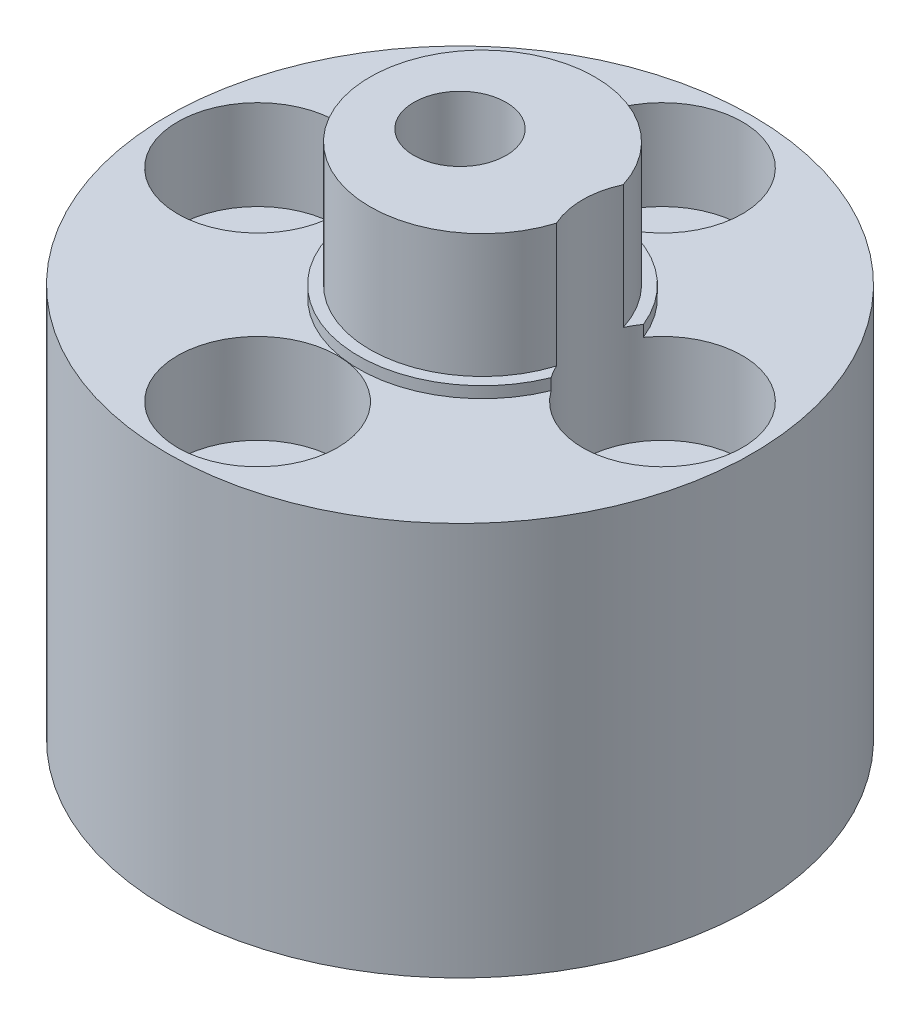
ISO-10303-21;
HEADER;
FILE_DESCRIPTION(('STEP AP214'),'2;1');
FILE_NAME('part.step','',(''),(''),'','','');
FILE_SCHEMA(('AUTOMOTIVE_DESIGN { 1 0 10303 214 1 1 1 1 }'));
ENDSEC;
DATA;
#1=APPLICATION_CONTEXT('core data for automotive mechanical design processes');
#2=APPLICATION_PROTOCOL_DEFINITION('international standard','automotive_design',2000,#1);
#3=PRODUCT_CONTEXT('',#1,'mechanical');
#4=PRODUCT('Part','Part','',(#3));
#5=PRODUCT_RELATED_PRODUCT_CATEGORY('part','',(#4));
#6=PRODUCT_DEFINITION_FORMATION('','',#4);
#7=PRODUCT_DEFINITION_CONTEXT('part definition',#1,'design');
#8=PRODUCT_DEFINITION('design','',#6,#7);
#9=PRODUCT_DEFINITION_SHAPE('','',#8);
#10=(LENGTH_UNIT() NAMED_UNIT(*) SI_UNIT(.MILLI.,.METRE.));
#11=(NAMED_UNIT(*) PLANE_ANGLE_UNIT() SI_UNIT($,.RADIAN.));
#12=(NAMED_UNIT(*) SI_UNIT($,.STERADIAN.) SOLID_ANGLE_UNIT());
#13=UNCERTAINTY_MEASURE_WITH_UNIT(LENGTH_MEASURE(1.E-05),#10,'distance_accuracy_value','');
#14=(GEOMETRIC_REPRESENTATION_CONTEXT(3) GLOBAL_UNCERTAINTY_ASSIGNED_CONTEXT((#13)) GLOBAL_UNIT_ASSIGNED_CONTEXT((#10,
#11,#12)) REPRESENTATION_CONTEXT('',''));
#15=CARTESIAN_POINT('',(0.,0.,0.));
#16=DIRECTION('',(0.,0.,1.));
#17=DIRECTION('',(1.,0.,0.));
#18=AXIS2_PLACEMENT_3D('',#15,#16,#17);
#19=CARTESIAN_POINT('',(0.,23.5,0.));
#20=DIRECTION('',(0.,-1.,0.));
#21=DIRECTION('',(0.,0.,-1.));
#22=AXIS2_PLACEMENT_3D('',#19,#20,#21);
#23=CYLINDRICAL_SURFACE('',#22,2.05);
#24=CARTESIAN_POINT('',(0.,23.5,0.));
#25=DIRECTION('',(0.,1.,0.));
#26=DIRECTION('',(0.,0.,1.));
#27=AXIS2_PLACEMENT_3D('',#24,#25,#26);
#28=CIRCLE('',#27,2.05);
#29=CARTESIAN_POINT('',(0.,23.5,2.05));
#30=VERTEX_POINT('',#29);
#31=EDGE_CURVE('E163',#30,#30,#28,.T.);
#32=ORIENTED_EDGE('',*,*,#31,.T.);
#33=EDGE_LOOP('',(#32));
#34=FACE_BOUND('',#33,.T.);
#35=CARTESIAN_POINT('',(0.,10.,0.));
#36=DIRECTION('',(0.,-1.,0.));
#37=DIRECTION('',(0.,0.,-1.));
#38=AXIS2_PLACEMENT_3D('',#35,#36,#37);
#39=CIRCLE('',#38,2.05);
#40=CARTESIAN_POINT('',(0.,10.,-2.05));
#41=VERTEX_POINT('',#40);
#42=EDGE_CURVE('E43',#41,#41,#39,.T.);
#43=ORIENTED_EDGE('',*,*,#42,.T.);
#44=EDGE_LOOP('',(#43));
#45=FACE_BOUND('',#44,.T.);
#46=ADVANCED_FACE('F39',(#34,#45),#23,.F.);
#47=CARTESIAN_POINT('',(1.,18.,0.));
#48=DIRECTION('',(0.,-1.,0.));
#49=DIRECTION('',(0.,0.,-1.));
#50=AXIS2_PLACEMENT_3D('',#47,#48,#49);
#51=CYLINDRICAL_SURFACE('',#50,5.5);
#52=DIRECTION('',(0.,-1.,0.));
#53=VECTOR('',#52,1.);
#54=CARTESIAN_POINT('',(6.10296875000002,18.5,2.05175776750649));
#55=LINE('',#54,#53);
#56=CARTESIAN_POINT('',(6.10296875000002,18.,2.05175776750649));
#57=VERTEX_POINT('',#56);
#58=CARTESIAN_POINT('',(6.10296875000002,17.5,2.05175776750649));
#59=VERTEX_POINT('',#58);
#60=EDGE_CURVE('E186',#57,#59,#55,.T.);
#61=ORIENTED_EDGE('',*,*,#60,.F.);
#62=CARTESIAN_POINT('',(1.,18.,0.));
#63=DIRECTION('',(0.,1.,0.));
#64=DIRECTION('',(0.,0.,1.));
#65=AXIS2_PLACEMENT_3D('',#62,#63,#64);
#66=CIRCLE('',#65,5.5);
#67=CARTESIAN_POINT('',(6.10296874999997,18.,-2.05175776750661));
#68=VERTEX_POINT('',#67);
#69=EDGE_CURVE('E207',#68,#57,#66,.T.);
#70=ORIENTED_EDGE('',*,*,#69,.F.);
#71=DIRECTION('',(0.,-1.,0.));
#72=VECTOR('',#71,1.);
#73=CARTESIAN_POINT('',(6.10296874999997,18.5,-2.05175776750661));
#74=LINE('',#73,#72);
#75=CARTESIAN_POINT('',(6.10296874999997,17.5,-2.05175776750661));
#76=VERTEX_POINT('',#75);
#77=EDGE_CURVE('E179',#76,#68,#74,.F.);
#78=ORIENTED_EDGE('',*,*,#77,.F.);
#79=CARTESIAN_POINT('',(1.,17.5,0.));
#80=DIRECTION('',(0.,1.,0.));
#81=DIRECTION('',(0.,0.,1.));
#82=AXIS2_PLACEMENT_3D('',#79,#80,#81);
#83=CIRCLE('',#82,5.5);
#84=EDGE_CURVE('E205',#76,#59,#83,.T.);
#85=ORIENTED_EDGE('',*,*,#84,.T.);
#86=EDGE_LOOP('',(#61,#70,#78,#85));
#87=FACE_BOUND('',#86,.T.);
#88=ADVANCED_FACE('F265',(#87),#51,.T.);
#89=CARTESIAN_POINT('',(1.,23.5,0.));
#90=DIRECTION('',(0.,-1.,0.));
#91=DIRECTION('',(0.,0.,-1.));
#92=AXIS2_PLACEMENT_3D('',#89,#90,#91);
#93=CYLINDRICAL_SURFACE('',#92,5.);
#94=DIRECTION('',(0.,-1.,0.));
#95=VECTOR('',#94,1.);
#96=CARTESIAN_POINT('',(5.77484375000001,18.5,1.48353198923575));
#97=LINE('',#96,#95);
#98=CARTESIAN_POINT('',(5.77484375000002,23.5,1.48353198923575));
#99=VERTEX_POINT('',#98);
#100=CARTESIAN_POINT('',(5.77484375000001,18.,1.48353198923575));
#101=VERTEX_POINT('',#100);
#102=EDGE_CURVE('E11',#99,#101,#97,.T.);
#103=ORIENTED_EDGE('',*,*,#102,.F.);
#104=CARTESIAN_POINT('',(1.,23.5,0.));
#105=DIRECTION('',(0.,1.,0.));
#106=DIRECTION('',(0.,0.,1.));
#107=AXIS2_PLACEMENT_3D('',#104,#105,#106);
#108=CIRCLE('',#107,5.);
#109=CARTESIAN_POINT('',(5.77484374999998,23.5,-1.48353198923587));
#110=VERTEX_POINT('',#109);
#111=EDGE_CURVE('E213',#110,#99,#108,.T.);
#112=ORIENTED_EDGE('',*,*,#111,.F.);
#113=DIRECTION('',(0.,-1.,0.));
#114=VECTOR('',#113,1.);
#115=CARTESIAN_POINT('',(5.77484374999998,18.5,-1.48353198923587));
#116=LINE('',#115,#114);
#117=CARTESIAN_POINT('',(5.77484374999998,18.,-1.48353198923587));
#118=VERTEX_POINT('',#117);
#119=EDGE_CURVE('E48',#118,#110,#116,.F.);
#120=ORIENTED_EDGE('',*,*,#119,.F.);
#121=CARTESIAN_POINT('',(1.,18.,0.));
#122=DIRECTION('',(0.,1.,0.));
#123=DIRECTION('',(0.,0.,1.));
#124=AXIS2_PLACEMENT_3D('',#121,#122,#123);
#125=CIRCLE('',#124,5.);
#126=EDGE_CURVE('E210',#118,#101,#125,.T.);
#127=ORIENTED_EDGE('',*,*,#126,.T.);
#128=EDGE_LOOP('',(#103,#112,#120,#127));
#129=FACE_BOUND('',#128,.T.);
#130=ADVANCED_FACE('F270',(#129),#93,.T.);
#131=CARTESIAN_POINT('',(8.99999999999999,23.5,0.));
#132=DIRECTION('',(0.,-1.,0.));
#133=DIRECTION('',(0.,0.,-1.));
#134=AXIS2_PLACEMENT_3D('',#131,#132,#133);
#135=CYLINDRICAL_SURFACE('',#134,1.65);
#136=CARTESIAN_POINT('',(8.99999999999999,0.,0.));
#137=DIRECTION('',(0.,1.,0.));
#138=DIRECTION('',(-1.,0.,0.));
#139=AXIS2_PLACEMENT_3D('',#136,#137,#138);
#140=CIRCLE('',#139,1.65);
#141=CARTESIAN_POINT('',(7.34999999999999,0.,0.));
#142=VERTEX_POINT('',#141);
#143=EDGE_CURVE('E195',#142,#142,#140,.T.);
#144=ORIENTED_EDGE('',*,*,#143,.F.);
#145=EDGE_LOOP('',(#144));
#146=FACE_BOUND('',#145,.T.);
#147=CARTESIAN_POINT('',(8.99999999999999,13.5,0.));
#148=DIRECTION('',(0.,1.,0.));
#149=DIRECTION('',(0.,0.,1.));
#150=AXIS2_PLACEMENT_3D('',#147,#148,#149);
#151=CIRCLE('',#150,1.65);
#152=CARTESIAN_POINT('',(8.99999999999999,13.5,1.64999999999991));
#153=VERTEX_POINT('',#152);
#154=EDGE_CURVE('E180',#153,#153,#151,.T.);
#155=ORIENTED_EDGE('',*,*,#154,.T.);
#156=EDGE_LOOP('',(#155));
#157=FACE_BOUND('',#156,.T.);
#158=ADVANCED_FACE('F513',(#146,#157),#135,.F.);
#159=CARTESIAN_POINT('',(0.,23.5,8.99999999999999));
#160=DIRECTION('',(0.,-1.,0.));
#161=DIRECTION('',(0.,0.,-1.));
#162=AXIS2_PLACEMENT_3D('',#159,#160,#161);
#163=CYLINDRICAL_SURFACE('',#162,1.65);
#164=CARTESIAN_POINT('',(0.,0.,8.99999999999999));
#165=DIRECTION('',(0.,1.,0.));
#166=DIRECTION('',(0.,0.,-1.));
#167=AXIS2_PLACEMENT_3D('',#164,#165,#166);
#168=CIRCLE('',#167,1.65);
#169=CARTESIAN_POINT('',(0.,0.,7.34999999999999));
#170=VERTEX_POINT('',#169);
#171=EDGE_CURVE('E192',#170,#170,#168,.T.);
#172=ORIENTED_EDGE('',*,*,#171,.F.);
#173=EDGE_LOOP('',(#172));
#174=FACE_BOUND('',#173,.T.);
#175=CARTESIAN_POINT('',(0.,13.5,8.99999999999999));
#176=DIRECTION('',(0.,1.,0.));
#177=DIRECTION('',(0.,0.,1.));
#178=AXIS2_PLACEMENT_3D('',#175,#176,#177);
#179=CIRCLE('',#178,1.65);
#180=CARTESIAN_POINT('',(0.,13.5,10.65));
#181=VERTEX_POINT('',#180);
#182=EDGE_CURVE('E230',#181,#181,#179,.T.);
#183=ORIENTED_EDGE('',*,*,#182,.T.);
#184=EDGE_LOOP('',(#183));
#185=FACE_BOUND('',#184,.T.);
#186=ADVANCED_FACE('F500',(#174,#185),#163,.F.);
#187=CARTESIAN_POINT('',(-8.99999999999999,23.5,0.));
#188=DIRECTION('',(0.,-1.,0.));
#189=DIRECTION('',(0.,0.,-1.));
#190=AXIS2_PLACEMENT_3D('',#187,#188,#189);
#191=CYLINDRICAL_SURFACE('',#190,1.65);
#192=CARTESIAN_POINT('',(-8.99999999999999,0.,0.));
#193=DIRECTION('',(0.,1.,0.));
#194=DIRECTION('',(1.,0.,0.));
#195=AXIS2_PLACEMENT_3D('',#192,#193,#194);
#196=CIRCLE('',#195,1.65);
#197=CARTESIAN_POINT('',(-7.34999999999999,0.,0.));
#198=VERTEX_POINT('',#197);
#199=EDGE_CURVE('E188',#198,#198,#196,.T.);
#200=ORIENTED_EDGE('',*,*,#199,.F.);
#201=EDGE_LOOP('',(#200));
#202=FACE_BOUND('',#201,.T.);
#203=CARTESIAN_POINT('',(-8.99999999999999,13.5,0.));
#204=DIRECTION('',(0.,1.,0.));
#205=DIRECTION('',(0.,0.,1.));
#206=AXIS2_PLACEMENT_3D('',#203,#204,#205);
#207=CIRCLE('',#206,1.65);
#208=CARTESIAN_POINT('',(-8.99999999999999,13.5,1.65000000000003));
#209=VERTEX_POINT('',#208);
#210=EDGE_CURVE('E170',#209,#209,#207,.T.);
#211=ORIENTED_EDGE('',*,*,#210,.T.);
#212=EDGE_LOOP('',(#211));
#213=FACE_BOUND('',#212,.T.);
#214=ADVANCED_FACE('F493',(#202,#213),#191,.F.);
#215=CARTESIAN_POINT('',(0.,23.5,-8.99999999999999));
#216=DIRECTION('',(0.,-1.,0.));
#217=DIRECTION('',(0.,0.,-1.));
#218=AXIS2_PLACEMENT_3D('',#215,#216,#217);
#219=CYLINDRICAL_SURFACE('',#218,1.65);
#220=CARTESIAN_POINT('',(0.,0.,-8.99999999999999));
#221=DIRECTION('',(0.,1.,0.));
#222=DIRECTION('',(0.,0.,1.));
#223=AXIS2_PLACEMENT_3D('',#220,#221,#222);
#224=CIRCLE('',#223,1.65);
#225=CARTESIAN_POINT('',(0.,0.,-7.34999999999999));
#226=VERTEX_POINT('',#225);
#227=EDGE_CURVE('E202',#226,#226,#224,.T.);
#228=ORIENTED_EDGE('',*,*,#227,.F.);
#229=EDGE_LOOP('',(#228));
#230=FACE_BOUND('',#229,.T.);
#231=CARTESIAN_POINT('',(0.,13.5,-8.99999999999999));
#232=DIRECTION('',(0.,1.,0.));
#233=DIRECTION('',(0.,0.,1.));
#234=AXIS2_PLACEMENT_3D('',#231,#232,#233);
#235=CIRCLE('',#234,1.65);
#236=CARTESIAN_POINT('',(0.,13.5,-7.34999999999999));
#237=VERTEX_POINT('',#236);
#238=EDGE_CURVE('E201',#237,#237,#235,.T.);
#239=ORIENTED_EDGE('',*,*,#238,.T.);
#240=EDGE_LOOP('',(#239));
#241=FACE_BOUND('',#240,.T.);
#242=ADVANCED_FACE('F499',(#230,#241),#219,.F.);
#243=CARTESIAN_POINT('',(0.,17.5,0.));
#244=DIRECTION('',(0.,-1.,0.));
#245=DIRECTION('',(0.,0.,-1.));
#246=AXIS2_PLACEMENT_3D('',#243,#244,#245);
#247=CYLINDRICAL_SURFACE('',#246,13.);
#248=CARTESIAN_POINT('',(0.,17.5,0.));
#249=DIRECTION('',(0.,1.,0.));
#250=DIRECTION('',(0.,0.,1.));
#251=AXIS2_PLACEMENT_3D('',#248,#249,#250);
#252=CIRCLE('',#251,13.);
#253=CARTESIAN_POINT('',(0.,17.5,13.));
#254=VERTEX_POINT('',#253);
#255=EDGE_CURVE('E217',#254,#254,#252,.T.);
#256=ORIENTED_EDGE('',*,*,#255,.F.);
#257=EDGE_LOOP('',(#256));
#258=FACE_BOUND('',#257,.T.);
#259=CARTESIAN_POINT('',(0.,0.,0.));
#260=DIRECTION('',(0.,1.,0.));
#261=DIRECTION('',(0.,0.,1.));
#262=AXIS2_PLACEMENT_3D('',#259,#260,#261);
#263=CIRCLE('',#262,13.);
#264=CARTESIAN_POINT('',(0.,0.,13.));
#265=VERTEX_POINT('',#264);
#266=EDGE_CURVE('E216',#265,#265,#263,.T.);
#267=ORIENTED_EDGE('',*,*,#266,.T.);
#268=EDGE_LOOP('',(#267));
#269=FACE_BOUND('',#268,.T.);
#270=ADVANCED_FACE('F41',(#258,#269),#247,.T.);
#271=CARTESIAN_POINT('',(0.,17.5,0.));
#272=DIRECTION('',(0.,1.,0.));
#273=DIRECTION('',(0.,0.,1.));
#274=AXIS2_PLACEMENT_3D('',#271,#272,#273);
#275=PLANE('',#274);
#276=CARTESIAN_POINT('',(-8.99999999999999,17.5,0.));
#277=DIRECTION('',(0.,1.,0.));
#278=DIRECTION('',(0.,0.,1.));
#279=AXIS2_PLACEMENT_3D('',#276,#277,#278);
#280=CIRCLE('',#279,3.55);
#281=CARTESIAN_POINT('',(-8.99999999999999,17.5,3.55000000000003));
#282=VERTEX_POINT('',#281);
#283=EDGE_CURVE('E198',#282,#282,#280,.F.);
#284=ORIENTED_EDGE('',*,*,#283,.T.);
#285=EDGE_LOOP('',(#284));
#286=FACE_BOUND('',#285,.T.);
#287=CARTESIAN_POINT('',(0.,17.5,8.99999999999999));
#288=DIRECTION('',(0.,1.,0.));
#289=DIRECTION('',(0.,0.,1.));
#290=AXIS2_PLACEMENT_3D('',#287,#288,#289);
#291=CIRCLE('',#290,3.55);
#292=CARTESIAN_POINT('',(0.,17.5,12.55));
#293=VERTEX_POINT('',#292);
#294=EDGE_CURVE('E236',#293,#293,#291,.F.);
#295=ORIENTED_EDGE('',*,*,#294,.T.);
#296=EDGE_LOOP('',(#295));
#297=FACE_BOUND('',#296,.T.);
#298=CARTESIAN_POINT('',(0.,17.5,-8.99999999999999));
#299=DIRECTION('',(0.,1.,0.));
#300=DIRECTION('',(0.,0.,1.));
#301=AXIS2_PLACEMENT_3D('',#298,#299,#300);
#302=CIRCLE('',#301,3.55);
#303=CARTESIAN_POINT('',(0.,17.5,-5.44999999999999));
#304=VERTEX_POINT('',#303);
#305=EDGE_CURVE('E206',#304,#304,#302,.F.);
#306=ORIENTED_EDGE('',*,*,#305,.T.);
#307=EDGE_LOOP('',(#306));
#308=FACE_BOUND('',#307,.T.);
#309=ORIENTED_EDGE('',*,*,#84,.F.);
#310=CARTESIAN_POINT('',(8.99999999999999,17.5,0.));
#311=DIRECTION('',(0.,1.,0.));
#312=DIRECTION('',(0.,0.,1.));
#313=AXIS2_PLACEMENT_3D('',#310,#311,#312);
#314=CIRCLE('',#313,3.55);
#315=EDGE_CURVE('E183',#76,#59,#314,.F.);
#316=ORIENTED_EDGE('',*,*,#315,.T.);
#317=EDGE_LOOP('',(#309,#316));
#318=FACE_BOUND('',#317,.T.);
#319=ORIENTED_EDGE('',*,*,#255,.T.);
#320=EDGE_LOOP('',(#319));
#321=FACE_BOUND('',#320,.T.);
#322=ADVANCED_FACE('F241',(#286,#297,#308,#318,#321),#275,.T.);
#323=CARTESIAN_POINT('',(0.,0.,0.));
#324=DIRECTION('',(0.,1.,0.));
#325=DIRECTION('',(0.,0.,1.));
#326=AXIS2_PLACEMENT_3D('',#323,#324,#325);
#327=PLANE('',#326);
#328=DIRECTION('',(-0.5,0.,0.866025403784438));
#329=VECTOR('',#328,1.);
#330=CARTESIAN_POINT('',(4.61880215351701,0.,0.));
#331=LINE('',#330,#329);
#332=CARTESIAN_POINT('',(4.61880215351701,0.,0.));
#333=VERTEX_POINT('',#332);
#334=CARTESIAN_POINT('',(2.3094010767585,0.,4.));
#335=VERTEX_POINT('',#334);
#336=EDGE_CURVE('E133',#333,#335,#331,.T.);
#337=ORIENTED_EDGE('',*,*,#336,.F.);
#338=DIRECTION('',(0.5,0.,0.866025403784439));
#339=VECTOR('',#338,1.);
#340=CARTESIAN_POINT('',(2.3094010767585,0.,-4.));
#341=LINE('',#340,#339);
#342=CARTESIAN_POINT('',(2.3094010767585,0.,-4.));
#343=VERTEX_POINT('',#342);
#344=EDGE_CURVE('E56',#343,#333,#341,.T.);
#345=ORIENTED_EDGE('',*,*,#344,.F.);
#346=DIRECTION('',(1.,0.,0.));
#347=VECTOR('',#346,1.);
#348=CARTESIAN_POINT('',(-2.3094010767585,0.,-4.));
#349=LINE('',#348,#347);
#350=CARTESIAN_POINT('',(-2.3094010767585,0.,-4.));
#351=VERTEX_POINT('',#350);
#352=EDGE_CURVE('E149',#351,#343,#349,.T.);
#353=ORIENTED_EDGE('',*,*,#352,.F.);
#354=DIRECTION('',(0.5,0.,-0.866025403784438));
#355=VECTOR('',#354,1.);
#356=CARTESIAN_POINT('',(-4.61880215351701,0.,0.));
#357=LINE('',#356,#355);
#358=CARTESIAN_POINT('',(-4.61880215351701,0.,0.));
#359=VERTEX_POINT('',#358);
#360=EDGE_CURVE('E143',#359,#351,#357,.T.);
#361=ORIENTED_EDGE('',*,*,#360,.F.);
#362=DIRECTION('',(-0.5,0.,-0.866025403784438));
#363=VECTOR('',#362,1.);
#364=CARTESIAN_POINT('',(-2.3094010767585,0.,4.));
#365=LINE('',#364,#363);
#366=CARTESIAN_POINT('',(-2.3094010767585,0.,4.));
#367=VERTEX_POINT('',#366);
#368=EDGE_CURVE('E141',#367,#359,#365,.T.);
#369=ORIENTED_EDGE('',*,*,#368,.F.);
#370=DIRECTION('',(-1.,0.,0.));
#371=VECTOR('',#370,1.);
#372=CARTESIAN_POINT('',(2.3094010767585,0.,4.));
#373=LINE('',#372,#371);
#374=EDGE_CURVE('E123',#335,#367,#373,.T.);
#375=ORIENTED_EDGE('',*,*,#374,.F.);
#376=EDGE_LOOP('',(#337,#345,#353,#361,#369,#375));
#377=FACE_BOUND('',#376,.T.);
#378=ORIENTED_EDGE('',*,*,#199,.T.);
#379=EDGE_LOOP('',(#378));
#380=FACE_BOUND('',#379,.T.);
#381=ORIENTED_EDGE('',*,*,#171,.T.);
#382=EDGE_LOOP('',(#381));
#383=FACE_BOUND('',#382,.T.);
#384=ORIENTED_EDGE('',*,*,#143,.T.);
#385=EDGE_LOOP('',(#384));
#386=FACE_BOUND('',#385,.T.);
#387=ORIENTED_EDGE('',*,*,#227,.T.);
#388=EDGE_LOOP('',(#387));
#389=FACE_BOUND('',#388,.T.);
#390=ORIENTED_EDGE('',*,*,#266,.F.);
#391=EDGE_LOOP('',(#390));
#392=FACE_BOUND('',#391,.T.);
#393=ADVANCED_FACE('F137',(#377,#380,#383,#386,#389,#392),#327,.F.);
#394=CARTESIAN_POINT('',(1.,18.,0.));
#395=DIRECTION('',(0.,1.,0.));
#396=DIRECTION('',(0.,0.,1.));
#397=AXIS2_PLACEMENT_3D('',#394,#395,#396);
#398=PLANE('',#397);
#399=ORIENTED_EDGE('',*,*,#69,.T.);
#400=CARTESIAN_POINT('',(8.99999999999999,18.,0.));
#401=DIRECTION('',(0.,1.,0.));
#402=DIRECTION('',(0.,0.,1.));
#403=AXIS2_PLACEMENT_3D('',#400,#401,#402);
#404=CIRCLE('',#403,3.55);
#405=EDGE_CURVE('E181',#57,#101,#404,.F.);
#406=ORIENTED_EDGE('',*,*,#405,.T.);
#407=ORIENTED_EDGE('',*,*,#126,.F.);
#408=EDGE_CURVE('E64',#118,#68,#404,.F.);
#409=ORIENTED_EDGE('',*,*,#408,.T.);
#410=EDGE_LOOP('',(#399,#406,#407,#409));
#411=FACE_BOUND('',#410,.T.);
#412=ADVANCED_FACE('F384',(#411),#398,.T.);
#413=CARTESIAN_POINT('',(1.,23.5,0.));
#414=DIRECTION('',(0.,1.,0.));
#415=DIRECTION('',(0.,0.,1.));
#416=AXIS2_PLACEMENT_3D('',#413,#414,#415);
#417=PLANE('',#416);
#418=ORIENTED_EDGE('',*,*,#31,.F.);
#419=EDGE_LOOP('',(#418));
#420=FACE_BOUND('',#419,.T.);
#421=ORIENTED_EDGE('',*,*,#111,.T.);
#422=CARTESIAN_POINT('',(8.99999999999999,23.5,0.));
#423=DIRECTION('',(0.,1.,0.));
#424=DIRECTION('',(-1.,0.,0.));
#425=AXIS2_PLACEMENT_3D('',#422,#423,#424);
#426=CIRCLE('',#425,3.55);
#427=EDGE_CURVE('E174',#110,#99,#426,.T.);
#428=ORIENTED_EDGE('',*,*,#427,.F.);
#429=EDGE_LOOP('',(#421,#428));
#430=FACE_BOUND('',#429,.T.);
#431=ADVANCED_FACE('F402',(#420,#430),#417,.T.);
#432=CARTESIAN_POINT('',(0.,23.5,-8.99999999999999));
#433=DIRECTION('',(0.,-1.,0.));
#434=DIRECTION('',(0.,0.,-1.));
#435=AXIS2_PLACEMENT_3D('',#432,#433,#434);
#436=CYLINDRICAL_SURFACE('',#435,3.55);
#437=ORIENTED_EDGE('',*,*,#305,.F.);
#438=EDGE_LOOP('',(#437));
#439=FACE_BOUND('',#438,.T.);
#440=CARTESIAN_POINT('',(0.,13.5,-8.99999999999999));
#441=DIRECTION('',(0.,1.,0.));
#442=DIRECTION('',(0.,0.,1.));
#443=AXIS2_PLACEMENT_3D('',#440,#441,#442);
#444=CIRCLE('',#443,3.55);
#445=CARTESIAN_POINT('',(0.,13.5,-5.44999999999999));
#446=VERTEX_POINT('',#445);
#447=EDGE_CURVE('E191',#446,#446,#444,.T.);
#448=ORIENTED_EDGE('',*,*,#447,.F.);
#449=EDGE_LOOP('',(#448));
#450=FACE_BOUND('',#449,.T.);
#451=ADVANCED_FACE('F407',(#439,#450),#436,.F.);
#452=CARTESIAN_POINT('',(0.,13.5,-8.99999999999999));
#453=DIRECTION('',(0.,1.,0.));
#454=DIRECTION('',(0.,0.,1.));
#455=AXIS2_PLACEMENT_3D('',#452,#453,#454);
#456=PLANE('',#455);
#457=ORIENTED_EDGE('',*,*,#238,.F.);
#458=EDGE_LOOP('',(#457));
#459=FACE_BOUND('',#458,.T.);
#460=ORIENTED_EDGE('',*,*,#447,.T.);
#461=EDGE_LOOP('',(#460));
#462=FACE_BOUND('',#461,.T.);
#463=ADVANCED_FACE('F248',(#459,#462),#456,.T.);
#464=CARTESIAN_POINT('',(-8.99999999999999,23.5,0.));
#465=DIRECTION('',(0.,-1.,0.));
#466=DIRECTION('',(0.,0.,-1.));
#467=AXIS2_PLACEMENT_3D('',#464,#465,#466);
#468=CYLINDRICAL_SURFACE('',#467,3.55);
#469=ORIENTED_EDGE('',*,*,#283,.F.);
#470=EDGE_LOOP('',(#469));
#471=FACE_BOUND('',#470,.T.);
#472=CARTESIAN_POINT('',(-8.99999999999999,13.5,0.));
#473=DIRECTION('',(0.,1.,0.));
#474=DIRECTION('',(1.,0.,0.));
#475=AXIS2_PLACEMENT_3D('',#472,#473,#474);
#476=CIRCLE('',#475,3.55);
#477=CARTESIAN_POINT('',(-5.44999999999999,13.5,0.));
#478=VERTEX_POINT('',#477);
#479=EDGE_CURVE('E167',#478,#478,#476,.T.);
#480=ORIENTED_EDGE('',*,*,#479,.F.);
#481=EDGE_LOOP('',(#480));
#482=FACE_BOUND('',#481,.T.);
#483=ADVANCED_FACE('F244',(#471,#482),#468,.F.);
#484=CARTESIAN_POINT('',(-8.99999999999999,13.5,0.));
#485=DIRECTION('',(0.,1.,0.));
#486=DIRECTION('',(1.,0.,0.));
#487=AXIS2_PLACEMENT_3D('',#484,#485,#486);
#488=PLANE('',#487);
#489=ORIENTED_EDGE('',*,*,#210,.F.);
#490=EDGE_LOOP('',(#489));
#491=FACE_BOUND('',#490,.T.);
#492=ORIENTED_EDGE('',*,*,#479,.T.);
#493=EDGE_LOOP('',(#492));
#494=FACE_BOUND('',#493,.T.);
#495=ADVANCED_FACE('F247',(#491,#494),#488,.T.);
#496=CARTESIAN_POINT('',(0.,23.5,8.99999999999999));
#497=DIRECTION('',(0.,-1.,0.));
#498=DIRECTION('',(0.,0.,-1.));
#499=AXIS2_PLACEMENT_3D('',#496,#497,#498);
#500=CYLINDRICAL_SURFACE('',#499,3.55);
#501=ORIENTED_EDGE('',*,*,#294,.F.);
#502=EDGE_LOOP('',(#501));
#503=FACE_BOUND('',#502,.T.);
#504=CARTESIAN_POINT('',(0.,13.5,8.99999999999999));
#505=DIRECTION('',(0.,1.,0.));
#506=DIRECTION('',(0.,0.,-1.));
#507=AXIS2_PLACEMENT_3D('',#504,#505,#506);
#508=CIRCLE('',#507,3.55);
#509=CARTESIAN_POINT('',(0.,13.5,5.44999999999999));
#510=VERTEX_POINT('',#509);
#511=EDGE_CURVE('E171',#510,#510,#508,.T.);
#512=ORIENTED_EDGE('',*,*,#511,.F.);
#513=EDGE_LOOP('',(#512));
#514=FACE_BOUND('',#513,.T.);
#515=ADVANCED_FACE('F253',(#503,#514),#500,.F.);
#516=CARTESIAN_POINT('',(0.,13.5,8.99999999999999));
#517=DIRECTION('',(0.,1.,0.));
#518=DIRECTION('',(0.,0.,-1.));
#519=AXIS2_PLACEMENT_3D('',#516,#517,#518);
#520=PLANE('',#519);
#521=ORIENTED_EDGE('',*,*,#182,.F.);
#522=EDGE_LOOP('',(#521));
#523=FACE_BOUND('',#522,.T.);
#524=ORIENTED_EDGE('',*,*,#511,.T.);
#525=EDGE_LOOP('',(#524));
#526=FACE_BOUND('',#525,.T.);
#527=ADVANCED_FACE('F259',(#523,#526),#520,.T.);
#528=CARTESIAN_POINT('',(8.99999999999999,23.5,0.));
#529=DIRECTION('',(0.,-1.,0.));
#530=DIRECTION('',(0.,0.,-1.));
#531=AXIS2_PLACEMENT_3D('',#528,#529,#530);
#532=CYLINDRICAL_SURFACE('',#531,3.55);
#533=CARTESIAN_POINT('',(8.99999999999999,13.5,0.));
#534=DIRECTION('',(0.,1.,0.));
#535=DIRECTION('',(-1.,0.,0.));
#536=AXIS2_PLACEMENT_3D('',#533,#534,#535);
#537=CIRCLE('',#536,3.55);
#538=CARTESIAN_POINT('',(5.44999999999999,13.5,0.));
#539=VERTEX_POINT('',#538);
#540=EDGE_CURVE('E166',#539,#539,#537,.T.);
#541=ORIENTED_EDGE('',*,*,#540,.F.);
#542=EDGE_LOOP('',(#541));
#543=FACE_BOUND('',#542,.T.);
#544=ORIENTED_EDGE('',*,*,#102,.T.);
#545=ORIENTED_EDGE('',*,*,#405,.F.);
#546=ORIENTED_EDGE('',*,*,#60,.T.);
#547=ORIENTED_EDGE('',*,*,#315,.F.);
#548=ORIENTED_EDGE('',*,*,#77,.T.);
#549=ORIENTED_EDGE('',*,*,#408,.F.);
#550=ORIENTED_EDGE('',*,*,#119,.T.);
#551=ORIENTED_EDGE('',*,*,#427,.T.);
#552=EDGE_LOOP('',(#544,#545,#546,#547,#548,#549,#550,#551));
#553=FACE_BOUND('',#552,.T.);
#554=ADVANCED_FACE('F420',(#543,#553),#532,.F.);
#555=CARTESIAN_POINT('',(8.99999999999999,13.5,0.));
#556=DIRECTION('',(0.,1.,0.));
#557=DIRECTION('',(-1.,0.,0.));
#558=AXIS2_PLACEMENT_3D('',#555,#556,#557);
#559=PLANE('',#558);
#560=ORIENTED_EDGE('',*,*,#154,.F.);
#561=EDGE_LOOP('',(#560));
#562=FACE_BOUND('',#561,.T.);
#563=ORIENTED_EDGE('',*,*,#540,.T.);
#564=EDGE_LOOP('',(#563));
#565=FACE_BOUND('',#564,.T.);
#566=ADVANCED_FACE('F279',(#562,#565),#559,.T.);
#567=CARTESIAN_POINT('',(0.,10.,0.));
#568=DIRECTION('',(0.,-1.,0.));
#569=DIRECTION('',(0.,0.,-1.));
#570=AXIS2_PLACEMENT_3D('',#567,#568,#569);
#571=PLANE('',#570);
#572=ORIENTED_EDGE('',*,*,#42,.F.);
#573=EDGE_LOOP('',(#572));
#574=FACE_BOUND('',#573,.T.);
#575=DIRECTION('',(-0.5,0.,-0.866025403784439));
#576=VECTOR('',#575,1.);
#577=CARTESIAN_POINT('',(2.3094010767585,10.,-4.));
#578=LINE('',#577,#576);
#579=CARTESIAN_POINT('',(4.61880215351701,10.,0.));
#580=VERTEX_POINT('',#579);
#581=CARTESIAN_POINT('',(2.3094010767585,10.,-4.));
#582=VERTEX_POINT('',#581);
#583=EDGE_CURVE('E162',#580,#582,#578,.T.);
#584=ORIENTED_EDGE('',*,*,#583,.F.);
#585=DIRECTION('',(0.5,0.,-0.866025403784439));
#586=VECTOR('',#585,1.);
#587=CARTESIAN_POINT('',(4.61880215351701,10.,0.));
#588=LINE('',#587,#586);
#589=CARTESIAN_POINT('',(2.3094010767585,10.,4.));
#590=VERTEX_POINT('',#589);
#591=EDGE_CURVE('E160',#590,#580,#588,.T.);
#592=ORIENTED_EDGE('',*,*,#591,.F.);
#593=DIRECTION('',(1.,0.,0.));
#594=VECTOR('',#593,1.);
#595=CARTESIAN_POINT('',(2.3094010767585,10.,4.));
#596=LINE('',#595,#594);
#597=CARTESIAN_POINT('',(-2.3094010767585,10.,4.));
#598=VERTEX_POINT('',#597);
#599=EDGE_CURVE('E126',#598,#590,#596,.T.);
#600=ORIENTED_EDGE('',*,*,#599,.F.);
#601=DIRECTION('',(0.5,0.,0.866025403784439));
#602=VECTOR('',#601,1.);
#603=CARTESIAN_POINT('',(-2.3094010767585,10.,4.));
#604=LINE('',#603,#602);
#605=CARTESIAN_POINT('',(-4.618802153517,10.,0.));
#606=VERTEX_POINT('',#605);
#607=EDGE_CURVE('E310',#606,#598,#604,.T.);
#608=ORIENTED_EDGE('',*,*,#607,.F.);
#609=DIRECTION('',(-0.5,0.,0.866025403784439));
#610=VECTOR('',#609,1.);
#611=CARTESIAN_POINT('',(-4.61880215351701,10.,0.));
#612=LINE('',#611,#610);
#613=CARTESIAN_POINT('',(-2.3094010767585,10.,-4.));
#614=VERTEX_POINT('',#613);
#615=EDGE_CURVE('E307',#614,#606,#612,.T.);
#616=ORIENTED_EDGE('',*,*,#615,.F.);
#617=DIRECTION('',(-1.,0.,0.));
#618=VECTOR('',#617,1.);
#619=CARTESIAN_POINT('',(-2.3094010767585,10.,-4.));
#620=LINE('',#619,#618);
#621=EDGE_CURVE('E302',#582,#614,#620,.T.);
#622=ORIENTED_EDGE('',*,*,#621,.F.);
#623=EDGE_LOOP('',(#584,#592,#600,#608,#616,#622));
#624=FACE_BOUND('',#623,.T.);
#625=ADVANCED_FACE('F275',(#574,#624),#571,.T.);
#626=CARTESIAN_POINT('',(2.3094010767585,22.2202018532156,-4.));
#627=DIRECTION('',(0.866025403784439,0.,-0.5));
#628=DIRECTION('',(-0.5,0.,-0.866025403784439));
#629=AXIS2_PLACEMENT_3D('',#626,#627,#628);
#630=PLANE('',#629);
#631=ORIENTED_EDGE('',*,*,#583,.T.);
#632=DIRECTION('',(0.,-1.,0.));
#633=VECTOR('',#632,1.);
#634=CARTESIAN_POINT('',(2.3094010767585,22.2202018532156,-4.));
#635=LINE('',#634,#633);
#636=EDGE_CURVE('E152',#582,#343,#635,.T.);
#637=ORIENTED_EDGE('',*,*,#636,.T.);
#638=ORIENTED_EDGE('',*,*,#344,.T.);
#639=DIRECTION('',(0.,-1.,0.));
#640=VECTOR('',#639,1.);
#641=CARTESIAN_POINT('',(4.61880215351701,22.2202018532156,0.));
#642=LINE('',#641,#640);
#643=EDGE_CURVE('E130',#580,#333,#642,.T.);
#644=ORIENTED_EDGE('',*,*,#643,.F.);
#645=EDGE_LOOP('',(#631,#637,#638,#644));
#646=FACE_BOUND('',#645,.T.);
#647=ADVANCED_FACE('F278',(#646),#630,.F.);
#648=CARTESIAN_POINT('',(-2.3094010767585,22.2202018532156,-4.));
#649=DIRECTION('',(0.,0.,-1.));
#650=DIRECTION('',(-1.,0.,0.));
#651=AXIS2_PLACEMENT_3D('',#648,#649,#650);
#652=PLANE('',#651);
#653=ORIENTED_EDGE('',*,*,#621,.T.);
#654=DIRECTION('',(0.,-1.,0.));
#655=VECTOR('',#654,1.);
#656=CARTESIAN_POINT('',(-2.3094010767585,22.2202018532156,-4.));
#657=LINE('',#656,#655);
#658=EDGE_CURVE('E154',#614,#351,#657,.T.);
#659=ORIENTED_EDGE('',*,*,#658,.T.);
#660=ORIENTED_EDGE('',*,*,#352,.T.);
#661=ORIENTED_EDGE('',*,*,#636,.F.);
#662=EDGE_LOOP('',(#653,#659,#660,#661));
#663=FACE_BOUND('',#662,.T.);
#664=ADVANCED_FACE('F283',(#663),#652,.F.);
#665=CARTESIAN_POINT('',(-4.61880215351701,22.2202018532156,0.));
#666=DIRECTION('',(-0.866025403784438,0.,-0.5));
#667=DIRECTION('',(-0.5,0.,0.866025403784439));
#668=AXIS2_PLACEMENT_3D('',#665,#666,#667);
#669=PLANE('',#668);
#670=ORIENTED_EDGE('',*,*,#615,.T.);
#671=DIRECTION('',(0.,-1.,0.));
#672=VECTOR('',#671,1.);
#673=CARTESIAN_POINT('',(-4.61880215351701,22.2202018532156,0.));
#674=LINE('',#673,#672);
#675=EDGE_CURVE('E156',#606,#359,#674,.T.);
#676=ORIENTED_EDGE('',*,*,#675,.T.);
#677=ORIENTED_EDGE('',*,*,#360,.T.);
#678=ORIENTED_EDGE('',*,*,#658,.F.);
#679=EDGE_LOOP('',(#670,#676,#677,#678));
#680=FACE_BOUND('',#679,.T.);
#681=ADVANCED_FACE('F291',(#680),#669,.F.);
#682=CARTESIAN_POINT('',(-2.3094010767585,22.2202018532156,4.));
#683=DIRECTION('',(-0.866025403784439,0.,0.5));
#684=DIRECTION('',(0.5,0.,0.866025403784439));
#685=AXIS2_PLACEMENT_3D('',#682,#683,#684);
#686=PLANE('',#685);
#687=ORIENTED_EDGE('',*,*,#607,.T.);
#688=DIRECTION('',(0.,-1.,0.));
#689=VECTOR('',#688,1.);
#690=CARTESIAN_POINT('',(-2.3094010767585,22.2202018532156,4.));
#691=LINE('',#690,#689);
#692=EDGE_CURVE('E129',#598,#367,#691,.T.);
#693=ORIENTED_EDGE('',*,*,#692,.T.);
#694=ORIENTED_EDGE('',*,*,#368,.T.);
#695=ORIENTED_EDGE('',*,*,#675,.F.);
#696=EDGE_LOOP('',(#687,#693,#694,#695));
#697=FACE_BOUND('',#696,.T.);
#698=ADVANCED_FACE('F288',(#697),#686,.F.);
#699=CARTESIAN_POINT('',(2.3094010767585,22.2202018532156,4.));
#700=DIRECTION('',(0.,0.,1.));
#701=DIRECTION('',(1.,0.,0.));
#702=AXIS2_PLACEMENT_3D('',#699,#700,#701);
#703=PLANE('',#702);
#704=ORIENTED_EDGE('',*,*,#599,.T.);
#705=DIRECTION('',(0.,-1.,0.));
#706=VECTOR('',#705,1.);
#707=CARTESIAN_POINT('',(2.3094010767585,22.2202018532156,4.));
#708=LINE('',#707,#706);
#709=EDGE_CURVE('E118',#590,#335,#708,.T.);
#710=ORIENTED_EDGE('',*,*,#709,.T.);
#711=ORIENTED_EDGE('',*,*,#374,.T.);
#712=ORIENTED_EDGE('',*,*,#692,.F.);
#713=EDGE_LOOP('',(#704,#710,#711,#712));
#714=FACE_BOUND('',#713,.T.);
#715=ADVANCED_FACE('F120',(#714),#703,.F.);
#716=CARTESIAN_POINT('',(4.61880215351701,22.2202018532156,0.));
#717=DIRECTION('',(0.866025403784438,0.,0.5));
#718=DIRECTION('',(0.5,0.,-0.866025403784439));
#719=AXIS2_PLACEMENT_3D('',#716,#717,#718);
#720=PLANE('',#719);
#721=ORIENTED_EDGE('',*,*,#591,.T.);
#722=ORIENTED_EDGE('',*,*,#643,.T.);
#723=ORIENTED_EDGE('',*,*,#336,.T.);
#724=ORIENTED_EDGE('',*,*,#709,.F.);
#725=EDGE_LOOP('',(#721,#722,#723,#724));
#726=FACE_BOUND('',#725,.T.);
#727=ADVANCED_FACE('F134',(#726),#720,.F.);
#728=CLOSED_SHELL('',(#46,#88,#130,#158,#186,#214,#242,#270,#322,#393,#412,#431,#451,#463,#483,
#495,#515,#527,#554,#566,#625,#647,#664,#681,#698,#715,#727));
#729=MANIFOLD_SOLID_BREP('B2',#728);
#730=ADVANCED_BREP_SHAPE_REPRESENTATION('',(#18,#729),#14);
#731=SHAPE_DEFINITION_REPRESENTATION(#9,#730);
ENDSEC;
END-ISO-10303-21;
